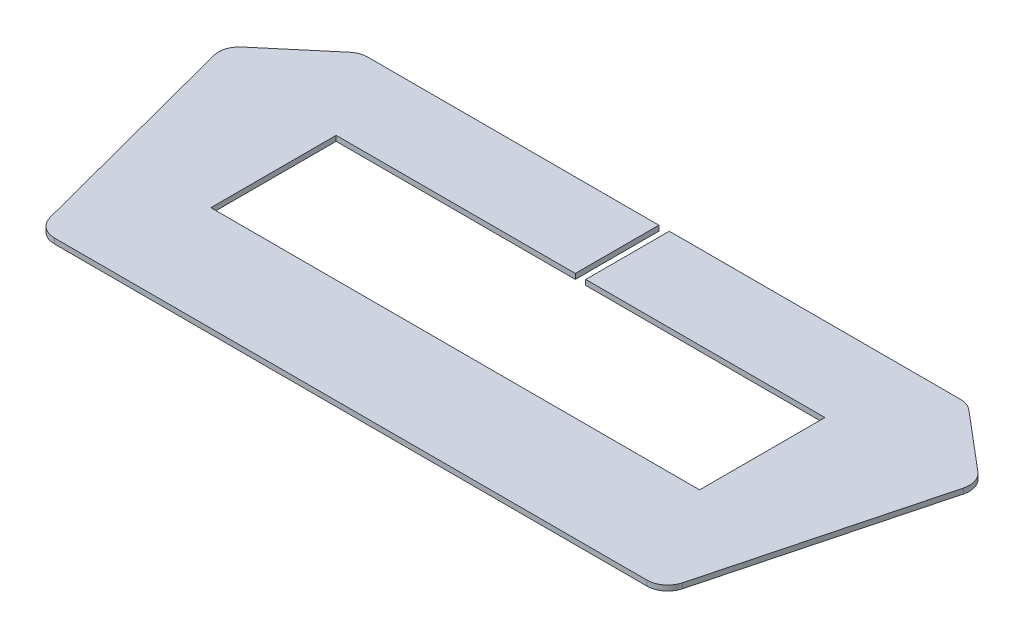
ISO-10303-21;
HEADER;
FILE_DESCRIPTION(('STEP AP214'),'2;1');
FILE_NAME('part.step','',(''),(''),'','','');
FILE_SCHEMA(('AUTOMOTIVE_DESIGN { 1 0 10303 214 1 1 1 1 }'));
ENDSEC;
DATA;
#1=APPLICATION_CONTEXT('core data for automotive mechanical design processes');
#2=APPLICATION_PROTOCOL_DEFINITION('international standard','automotive_design',2000,#1);
#3=PRODUCT_CONTEXT('',#1,'mechanical');
#4=PRODUCT('Part','Part','',(#3));
#5=PRODUCT_RELATED_PRODUCT_CATEGORY('part','',(#4));
#6=PRODUCT_DEFINITION_FORMATION('','',#4);
#7=PRODUCT_DEFINITION_CONTEXT('part definition',#1,'design');
#8=PRODUCT_DEFINITION('design','',#6,#7);
#9=PRODUCT_DEFINITION_SHAPE('','',#8);
#10=(LENGTH_UNIT() NAMED_UNIT(*) SI_UNIT(.MILLI.,.METRE.));
#11=(NAMED_UNIT(*) PLANE_ANGLE_UNIT() SI_UNIT($,.RADIAN.));
#12=(NAMED_UNIT(*) SI_UNIT($,.STERADIAN.) SOLID_ANGLE_UNIT());
#13=UNCERTAINTY_MEASURE_WITH_UNIT(LENGTH_MEASURE(1.E-05),#10,'distance_accuracy_value','');
#14=(GEOMETRIC_REPRESENTATION_CONTEXT(3) GLOBAL_UNCERTAINTY_ASSIGNED_CONTEXT((#13)) GLOBAL_UNIT_ASSIGNED_CONTEXT((#10,
#11,#12)) REPRESENTATION_CONTEXT('',''));
#15=CARTESIAN_POINT('',(0.,0.,0.));
#16=DIRECTION('',(0.,0.,1.));
#17=DIRECTION('',(1.,0.,0.));
#18=AXIS2_PLACEMENT_3D('',#15,#16,#17);
#19=CARTESIAN_POINT('',(-11.7,-0.25,-3.));
#20=DIRECTION('',(1.,0.,0.));
#21=DIRECTION('',(0.,0.,-1.));
#22=AXIS2_PLACEMENT_3D('',#19,#20,#21);
#23=PLANE('',#22);
#24=DIRECTION('',(0.,0.,-1.));
#25=VECTOR('',#24,1.);
#26=CARTESIAN_POINT('',(-11.7,0.,-3.));
#27=LINE('',#26,#25);
#28=CARTESIAN_POINT('',(-11.7,0.,3.));
#29=VERTEX_POINT('',#28);
#30=CARTESIAN_POINT('',(-11.7,0.,-3.));
#31=VERTEX_POINT('',#30);
#32=EDGE_CURVE('E209',#29,#31,#27,.T.);
#33=ORIENTED_EDGE('',*,*,#32,.F.);
#34=DIRECTION('',(0.,1.,0.));
#35=VECTOR('',#34,1.);
#36=CARTESIAN_POINT('',(-11.7,-0.25,3.));
#37=LINE('',#36,#35);
#38=CARTESIAN_POINT('',(-11.7,-0.25,3.));
#39=VERTEX_POINT('',#38);
#40=EDGE_CURVE('E12',#39,#29,#37,.T.);
#41=ORIENTED_EDGE('',*,*,#40,.F.);
#42=DIRECTION('',(0.,0.,-1.));
#43=VECTOR('',#42,1.);
#44=CARTESIAN_POINT('',(-11.7,-0.25,-3.));
#45=LINE('',#44,#43);
#46=CARTESIAN_POINT('',(-11.7,-0.25,-3.));
#47=VERTEX_POINT('',#46);
#48=EDGE_CURVE('E265',#39,#47,#45,.T.);
#49=ORIENTED_EDGE('',*,*,#48,.T.);
#50=DIRECTION('',(0.,1.,0.));
#51=VECTOR('',#50,1.);
#52=CARTESIAN_POINT('',(-11.7,-0.25,-3.));
#53=LINE('',#52,#51);
#54=EDGE_CURVE('E43',#47,#31,#53,.T.);
#55=ORIENTED_EDGE('',*,*,#54,.T.);
#56=EDGE_LOOP('',(#33,#41,#49,#55));
#57=FACE_BOUND('',#56,.T.);
#58=ADVANCED_FACE('F40',(#57),#23,.T.);
#59=CARTESIAN_POINT('',(-11.7,-0.25,3.));
#60=DIRECTION('',(0.,0.,-1.));
#61=DIRECTION('',(-1.,0.,0.));
#62=AXIS2_PLACEMENT_3D('',#59,#60,#61);
#63=PLANE('',#62);
#64=DIRECTION('',(-1.,0.,0.));
#65=VECTOR('',#64,1.);
#66=CARTESIAN_POINT('',(-11.7,0.,3.));
#67=LINE('',#66,#65);
#68=CARTESIAN_POINT('',(11.7,0.,3.));
#69=VERTEX_POINT('',#68);
#70=EDGE_CURVE('E263',#69,#29,#67,.T.);
#71=ORIENTED_EDGE('',*,*,#70,.F.);
#72=DIRECTION('',(0.,1.,0.));
#73=VECTOR('',#72,1.);
#74=CARTESIAN_POINT('',(11.7,-0.25,3.));
#75=LINE('',#74,#73);
#76=CARTESIAN_POINT('',(11.7,-0.25,3.));
#77=VERTEX_POINT('',#76);
#78=EDGE_CURVE('E49',#77,#69,#75,.T.);
#79=ORIENTED_EDGE('',*,*,#78,.F.);
#80=DIRECTION('',(-1.,0.,0.));
#81=VECTOR('',#80,1.);
#82=CARTESIAN_POINT('',(-11.7,-0.25,3.));
#83=LINE('',#82,#81);
#84=EDGE_CURVE('E199',#77,#39,#83,.T.);
#85=ORIENTED_EDGE('',*,*,#84,.T.);
#86=ORIENTED_EDGE('',*,*,#40,.T.);
#87=EDGE_LOOP('',(#71,#79,#85,#86));
#88=FACE_BOUND('',#87,.T.);
#89=ADVANCED_FACE('F301',(#88),#63,.T.);
#90=CARTESIAN_POINT('',(11.7,-0.25,-3.));
#91=DIRECTION('',(-1.,0.,0.));
#92=DIRECTION('',(0.,0.,1.));
#93=AXIS2_PLACEMENT_3D('',#90,#91,#92);
#94=PLANE('',#93);
#95=DIRECTION('',(0.,0.,1.));
#96=VECTOR('',#95,1.);
#97=CARTESIAN_POINT('',(11.7,0.,-3.));
#98=LINE('',#97,#96);
#99=CARTESIAN_POINT('',(11.7,0.,-3.));
#100=VERTEX_POINT('',#99);
#101=EDGE_CURVE('E186',#100,#69,#98,.T.);
#102=ORIENTED_EDGE('',*,*,#101,.F.);
#103=DIRECTION('',(0.,1.,0.));
#104=VECTOR('',#103,1.);
#105=CARTESIAN_POINT('',(11.7,-0.25,-3.));
#106=LINE('',#105,#104);
#107=CARTESIAN_POINT('',(11.7,-0.25,-3.));
#108=VERTEX_POINT('',#107);
#109=EDGE_CURVE('E181',#108,#100,#106,.T.);
#110=ORIENTED_EDGE('',*,*,#109,.F.);
#111=DIRECTION('',(0.,0.,1.));
#112=VECTOR('',#111,1.);
#113=CARTESIAN_POINT('',(11.7,-0.25,-3.));
#114=LINE('',#113,#112);
#115=EDGE_CURVE('E184',#108,#77,#114,.T.);
#116=ORIENTED_EDGE('',*,*,#115,.T.);
#117=ORIENTED_EDGE('',*,*,#78,.T.);
#118=EDGE_LOOP('',(#102,#110,#116,#117));
#119=FACE_BOUND('',#118,.T.);
#120=ADVANCED_FACE('F183',(#119),#94,.T.);
#121=CARTESIAN_POINT('',(0.25,-0.25,-3.));
#122=DIRECTION('',(0.,0.,1.));
#123=DIRECTION('',(1.,0.,0.));
#124=AXIS2_PLACEMENT_3D('',#121,#122,#123);
#125=PLANE('',#124);
#126=DIRECTION('',(1.,0.,0.));
#127=VECTOR('',#126,1.);
#128=CARTESIAN_POINT('',(0.25,0.,-3.));
#129=LINE('',#128,#127);
#130=CARTESIAN_POINT('',(0.25,0.,-3.));
#131=VERTEX_POINT('',#130);
#132=EDGE_CURVE('E260',#131,#100,#129,.T.);
#133=ORIENTED_EDGE('',*,*,#132,.F.);
#134=DIRECTION('',(0.,1.,0.));
#135=VECTOR('',#134,1.);
#136=CARTESIAN_POINT('',(0.25,-0.25,-3.));
#137=LINE('',#136,#135);
#138=CARTESIAN_POINT('',(0.25,-0.25,-3.));
#139=VERTEX_POINT('',#138);
#140=EDGE_CURVE('E191',#139,#131,#137,.T.);
#141=ORIENTED_EDGE('',*,*,#140,.F.);
#142=DIRECTION('',(1.,0.,0.));
#143=VECTOR('',#142,1.);
#144=CARTESIAN_POINT('',(0.25,-0.25,-3.));
#145=LINE('',#144,#143);
#146=EDGE_CURVE('E197',#139,#108,#145,.T.);
#147=ORIENTED_EDGE('',*,*,#146,.T.);
#148=ORIENTED_EDGE('',*,*,#109,.T.);
#149=EDGE_LOOP('',(#133,#141,#147,#148));
#150=FACE_BOUND('',#149,.T.);
#151=ADVANCED_FACE('F201',(#150),#125,.T.);
#152=CARTESIAN_POINT('',(0.249999999999999,-0.25,-7.));
#153=DIRECTION('',(-1.,0.,0.));
#154=DIRECTION('',(0.,0.,1.));
#155=AXIS2_PLACEMENT_3D('',#152,#153,#154);
#156=PLANE('',#155);
#157=DIRECTION('',(0.,0.,1.));
#158=VECTOR('',#157,1.);
#159=CARTESIAN_POINT('',(0.249999999999999,0.,-7.));
#160=LINE('',#159,#158);
#161=CARTESIAN_POINT('',(0.249999999999999,0.,-7.));
#162=VERTEX_POINT('',#161);
#163=EDGE_CURVE('E257',#162,#131,#160,.T.);
#164=ORIENTED_EDGE('',*,*,#163,.F.);
#165=DIRECTION('',(0.,1.,0.));
#166=VECTOR('',#165,1.);
#167=CARTESIAN_POINT('',(0.249999999999999,-0.25,-7.));
#168=LINE('',#167,#166);
#169=CARTESIAN_POINT('',(0.249999999999999,-0.25,-7.));
#170=VERTEX_POINT('',#169);
#171=EDGE_CURVE('E269',#170,#162,#168,.T.);
#172=ORIENTED_EDGE('',*,*,#171,.F.);
#173=DIRECTION('',(0.,0.,1.));
#174=VECTOR('',#173,1.);
#175=CARTESIAN_POINT('',(0.249999999999999,-0.25,-7.));
#176=LINE('',#175,#174);
#177=EDGE_CURVE('E202',#170,#139,#176,.T.);
#178=ORIENTED_EDGE('',*,*,#177,.T.);
#179=ORIENTED_EDGE('',*,*,#140,.T.);
#180=EDGE_LOOP('',(#164,#172,#178,#179));
#181=FACE_BOUND('',#180,.T.);
#182=ADVANCED_FACE('F314',(#181),#156,.T.);
#183=CARTESIAN_POINT('',(0.249999999999999,-0.25,-7.));
#184=DIRECTION('',(0.,0.,-1.));
#185=DIRECTION('',(-1.,0.,0.));
#186=AXIS2_PLACEMENT_3D('',#183,#184,#185);
#187=PLANE('',#186);
#188=DIRECTION('',(-1.,0.,0.));
#189=VECTOR('',#188,1.);
#190=CARTESIAN_POINT('',(0.249999999999999,0.,-7.));
#191=LINE('',#190,#189);
#192=CARTESIAN_POINT('',(14.1840503450521,0.,-7.));
#193=VERTEX_POINT('',#192);
#194=EDGE_CURVE('E254',#193,#162,#191,.T.);
#195=ORIENTED_EDGE('',*,*,#194,.F.);
#196=DIRECTION('',(0.,1.,0.));
#197=VECTOR('',#196,1.);
#198=CARTESIAN_POINT('',(14.1840503450521,-0.25,-7.));
#199=LINE('',#198,#197);
#200=CARTESIAN_POINT('',(14.1840503450521,-0.25,-7.));
#201=VERTEX_POINT('',#200);
#202=EDGE_CURVE('E271',#201,#193,#199,.T.);
#203=ORIENTED_EDGE('',*,*,#202,.F.);
#204=DIRECTION('',(-1.,0.,0.));
#205=VECTOR('',#204,1.);
#206=CARTESIAN_POINT('',(0.249999999999999,-0.25,-7.));
#207=LINE('',#206,#205);
#208=EDGE_CURVE('E204',#201,#170,#207,.T.);
#209=ORIENTED_EDGE('',*,*,#208,.T.);
#210=ORIENTED_EDGE('',*,*,#171,.T.);
#211=EDGE_LOOP('',(#195,#203,#209,#210));
#212=FACE_BOUND('',#211,.T.);
#213=ADVANCED_FACE('F317',(#212),#187,.T.);
#214=CARTESIAN_POINT('',(14.1840503450521,-0.25,-6.));
#215=DIRECTION('',(0.,1.,0.));
#216=DIRECTION('',(0.,0.,1.));
#217=AXIS2_PLACEMENT_3D('',#214,#215,#216);
#218=CYLINDRICAL_SURFACE('',#217,0.999999999999998);
#219=CARTESIAN_POINT('',(14.1840503450521,0.,-6.));
#220=DIRECTION('',(0.,1.,0.));
#221=DIRECTION('',(0.,0.,-1.));
#222=AXIS2_PLACEMENT_3D('',#219,#220,#221);
#223=CIRCLE('',#222,0.999999999999998);
#224=CARTESIAN_POINT('',(14.8295102174988,0.,-6.76379418239535));
#225=VERTEX_POINT('',#224);
#226=EDGE_CURVE('E251',#225,#193,#223,.T.);
#227=ORIENTED_EDGE('',*,*,#226,.F.);
#228=DIRECTION('',(0.,1.,0.));
#229=VECTOR('',#228,1.);
#230=CARTESIAN_POINT('',(14.8295102174988,-0.25,-6.76379418239535));
#231=LINE('',#230,#229);
#232=CARTESIAN_POINT('',(14.8295102174988,-0.25,-6.76379418239535));
#233=VERTEX_POINT('',#232);
#234=EDGE_CURVE('E273',#233,#225,#231,.T.);
#235=ORIENTED_EDGE('',*,*,#234,.F.);
#236=CARTESIAN_POINT('',(14.1840503450521,-0.25,-6.));
#237=DIRECTION('',(0.,1.,0.));
#238=DIRECTION('',(0.,0.,-1.));
#239=AXIS2_PLACEMENT_3D('',#236,#237,#238);
#240=CIRCLE('',#239,0.999999999999998);
#241=EDGE_CURVE('E644',#233,#201,#240,.T.);
#242=ORIENTED_EDGE('',*,*,#241,.T.);
#243=ORIENTED_EDGE('',*,*,#202,.T.);
#244=EDGE_LOOP('',(#227,#235,#242,#243));
#245=FACE_BOUND('',#244,.T.);
#246=ADVANCED_FACE('F321',(#245),#218,.T.);
#247=CARTESIAN_POINT('',(17.6180059015459,-0.25,-4.40731895644008));
#248=DIRECTION('',(0.645459872446779,0.,-0.763794182395355));
#249=DIRECTION('',(-0.763794182395355,0.,-0.645459872446779));
#250=AXIS2_PLACEMENT_3D('',#247,#248,#249);
#251=PLANE('',#250);
#252=DIRECTION('',(-0.763794182395355,0.,-0.645459872446779));
#253=VECTOR('',#252,1.);
#254=CARTESIAN_POINT('',(17.6180059015459,0.,-4.40731895644008));
#255=LINE('',#254,#253);
#256=CARTESIAN_POINT('',(17.6180059015459,0.,-4.40731895644008));
#257=VERTEX_POINT('',#256);
#258=EDGE_CURVE('E248',#257,#225,#255,.T.);
#259=ORIENTED_EDGE('',*,*,#258,.F.);
#260=DIRECTION('',(0.,1.,0.));
#261=VECTOR('',#260,1.);
#262=CARTESIAN_POINT('',(17.6180059015459,-0.25,-4.40731895644008));
#263=LINE('',#262,#261);
#264=CARTESIAN_POINT('',(17.6180059015459,-0.25,-4.40731895644008));
#265=VERTEX_POINT('',#264);
#266=EDGE_CURVE('E275',#265,#257,#263,.T.);
#267=ORIENTED_EDGE('',*,*,#266,.F.);
#268=DIRECTION('',(-0.763794182395355,0.,-0.645459872446779));
#269=VECTOR('',#268,1.);
#270=CARTESIAN_POINT('',(17.6180059015459,-0.25,-4.40731895644008));
#271=LINE('',#270,#269);
#272=EDGE_CURVE('E637',#265,#233,#271,.T.);
#273=ORIENTED_EDGE('',*,*,#272,.T.);
#274=ORIENTED_EDGE('',*,*,#234,.T.);
#275=EDGE_LOOP('',(#259,#267,#273,#274));
#276=FACE_BOUND('',#275,.T.);
#277=ADVANCED_FACE('F325',(#276),#251,.T.);
#278=CARTESIAN_POINT('',(16.9725460290991,-0.25,-3.64352477404472));
#279=DIRECTION('',(0.,1.,0.));
#280=DIRECTION('',(0.,0.,1.));
#281=AXIS2_PLACEMENT_3D('',#278,#279,#280);
#282=CYLINDRICAL_SURFACE('',#281,1.);
#283=CARTESIAN_POINT('',(16.9725460290991,0.,-3.64352477404472));
#284=DIRECTION('',(0.,1.,0.));
#285=DIRECTION('',(0.,0.,-1.));
#286=AXIS2_PLACEMENT_3D('',#283,#284,#285);
#287=CIRCLE('',#286,1.);
#288=CARTESIAN_POINT('',(17.9397769944786,0.,-3.38962664563262));
#289=VERTEX_POINT('',#288);
#290=EDGE_CURVE('E245',#289,#257,#287,.T.);
#291=ORIENTED_EDGE('',*,*,#290,.F.);
#292=DIRECTION('',(0.,1.,0.));
#293=VECTOR('',#292,1.);
#294=CARTESIAN_POINT('',(17.9397769944786,-0.25,-3.38962664563262));
#295=LINE('',#294,#293);
#296=CARTESIAN_POINT('',(17.9397769944786,-0.25,-3.38962664563262));
#297=VERTEX_POINT('',#296);
#298=EDGE_CURVE('E277',#297,#289,#295,.T.);
#299=ORIENTED_EDGE('',*,*,#298,.F.);
#300=CARTESIAN_POINT('',(16.9725460290991,-0.25,-3.64352477404472));
#301=DIRECTION('',(0.,1.,0.));
#302=DIRECTION('',(0.,0.,-1.));
#303=AXIS2_PLACEMENT_3D('',#300,#301,#302);
#304=CIRCLE('',#303,1.);
#305=EDGE_CURVE('E633',#297,#265,#304,.T.);
#306=ORIENTED_EDGE('',*,*,#305,.T.);
#307=ORIENTED_EDGE('',*,*,#266,.T.);
#308=EDGE_LOOP('',(#291,#299,#306,#307));
#309=FACE_BOUND('',#308,.T.);
#310=ADVANCED_FACE('F329',(#309),#282,.T.);
#311=CARTESIAN_POINT('',(15.1458517412918,-0.25,7.2538981284121));
#312=DIRECTION('',(0.967230965379434,0.,0.253898128412102));
#313=DIRECTION('',(0.253898128412102,0.,-0.967230965379434));
#314=AXIS2_PLACEMENT_3D('',#311,#312,#313);
#315=PLANE('',#314);
#316=DIRECTION('',(0.253898128412102,0.,-0.967230965379434));
#317=VECTOR('',#316,1.);
#318=CARTESIAN_POINT('',(15.1458517412918,0.,7.2538981284121));
#319=LINE('',#318,#317);
#320=CARTESIAN_POINT('',(15.1458517412918,0.,7.2538981284121));
#321=VERTEX_POINT('',#320);
#322=EDGE_CURVE('E242',#321,#289,#319,.T.);
#323=ORIENTED_EDGE('',*,*,#322,.F.);
#324=DIRECTION('',(0.,1.,0.));
#325=VECTOR('',#324,1.);
#326=CARTESIAN_POINT('',(15.1458517412918,-0.25,7.2538981284121));
#327=LINE('',#326,#325);
#328=CARTESIAN_POINT('',(15.1458517412918,-0.25,7.2538981284121));
#329=VERTEX_POINT('',#328);
#330=EDGE_CURVE('E279',#329,#321,#327,.T.);
#331=ORIENTED_EDGE('',*,*,#330,.F.);
#332=DIRECTION('',(0.253898128412102,0.,-0.967230965379434));
#333=VECTOR('',#332,1.);
#334=CARTESIAN_POINT('',(15.1458517412918,-0.25,7.2538981284121));
#335=LINE('',#334,#333);
#336=EDGE_CURVE('E649',#329,#297,#335,.T.);
#337=ORIENTED_EDGE('',*,*,#336,.T.);
#338=ORIENTED_EDGE('',*,*,#298,.T.);
#339=EDGE_LOOP('',(#323,#331,#337,#338));
#340=FACE_BOUND('',#339,.T.);
#341=ADVANCED_FACE('F333',(#340),#315,.T.);
#342=CARTESIAN_POINT('',(14.1786207759124,-0.25,7.));
#343=DIRECTION('',(0.,1.,0.));
#344=DIRECTION('',(0.,0.,1.));
#345=AXIS2_PLACEMENT_3D('',#342,#343,#344);
#346=CYLINDRICAL_SURFACE('',#345,1.);
#347=CARTESIAN_POINT('',(14.1786207759124,0.,7.));
#348=DIRECTION('',(0.,1.,0.));
#349=DIRECTION('',(0.,0.,1.));
#350=AXIS2_PLACEMENT_3D('',#347,#348,#349);
#351=CIRCLE('',#350,1.);
#352=CARTESIAN_POINT('',(14.1786207759124,0.,8.));
#353=VERTEX_POINT('',#352);
#354=EDGE_CURVE('E239',#353,#321,#351,.T.);
#355=ORIENTED_EDGE('',*,*,#354,.F.);
#356=DIRECTION('',(0.,1.,0.));
#357=VECTOR('',#356,1.);
#358=CARTESIAN_POINT('',(14.1786207759124,-0.25,8.));
#359=LINE('',#358,#357);
#360=CARTESIAN_POINT('',(14.1786207759124,-0.25,8.));
#361=VERTEX_POINT('',#360);
#362=EDGE_CURVE('E281',#361,#353,#359,.T.);
#363=ORIENTED_EDGE('',*,*,#362,.F.);
#364=CARTESIAN_POINT('',(14.1786207759124,-0.25,7.));
#365=DIRECTION('',(0.,1.,0.));
#366=DIRECTION('',(0.,0.,1.));
#367=AXIS2_PLACEMENT_3D('',#364,#365,#366);
#368=CIRCLE('',#367,1.);
#369=EDGE_CURVE('E626',#361,#329,#368,.T.);
#370=ORIENTED_EDGE('',*,*,#369,.T.);
#371=ORIENTED_EDGE('',*,*,#330,.T.);
#372=EDGE_LOOP('',(#355,#363,#370,#371));
#373=FACE_BOUND('',#372,.T.);
#374=ADVANCED_FACE('F337',(#373),#346,.T.);
#375=CARTESIAN_POINT('',(-14.1786207759124,-0.25,8.));
#376=DIRECTION('',(0.,0.,1.));
#377=DIRECTION('',(1.,0.,0.));
#378=AXIS2_PLACEMENT_3D('',#375,#376,#377);
#379=PLANE('',#378);
#380=DIRECTION('',(1.,0.,0.));
#381=VECTOR('',#380,1.);
#382=CARTESIAN_POINT('',(-14.1786207759124,0.,8.));
#383=LINE('',#382,#381);
#384=CARTESIAN_POINT('',(-14.1786207759124,0.,8.));
#385=VERTEX_POINT('',#384);
#386=EDGE_CURVE('E236',#385,#353,#383,.T.);
#387=ORIENTED_EDGE('',*,*,#386,.F.);
#388=DIRECTION('',(0.,1.,0.));
#389=VECTOR('',#388,1.);
#390=CARTESIAN_POINT('',(-14.1786207759124,-0.25,8.));
#391=LINE('',#390,#389);
#392=CARTESIAN_POINT('',(-14.1786207759124,-0.25,8.));
#393=VERTEX_POINT('',#392);
#394=EDGE_CURVE('E283',#393,#385,#391,.T.);
#395=ORIENTED_EDGE('',*,*,#394,.F.);
#396=DIRECTION('',(1.,0.,0.));
#397=VECTOR('',#396,1.);
#398=CARTESIAN_POINT('',(-14.1786207759124,-0.25,8.));
#399=LINE('',#398,#397);
#400=EDGE_CURVE('E622',#393,#361,#399,.T.);
#401=ORIENTED_EDGE('',*,*,#400,.T.);
#402=ORIENTED_EDGE('',*,*,#362,.T.);
#403=EDGE_LOOP('',(#387,#395,#401,#402));
#404=FACE_BOUND('',#403,.T.);
#405=ADVANCED_FACE('F341',(#404),#379,.T.);
#406=CARTESIAN_POINT('',(-14.1786207759124,-0.25,7.));
#407=DIRECTION('',(0.,1.,0.));
#408=DIRECTION('',(0.,0.,1.));
#409=AXIS2_PLACEMENT_3D('',#406,#407,#408);
#410=CYLINDRICAL_SURFACE('',#409,1.);
#411=CARTESIAN_POINT('',(-14.1786207759124,0.,7.));
#412=DIRECTION('',(0.,1.,0.));
#413=DIRECTION('',(0.,0.,-1.));
#414=AXIS2_PLACEMENT_3D('',#411,#412,#413);
#415=CIRCLE('',#414,1.);
#416=CARTESIAN_POINT('',(-15.1458517412918,0.,7.2538981284121));
#417=VERTEX_POINT('',#416);
#418=EDGE_CURVE('E233',#417,#385,#415,.T.);
#419=ORIENTED_EDGE('',*,*,#418,.F.);
#420=DIRECTION('',(0.,1.,0.));
#421=VECTOR('',#420,1.);
#422=CARTESIAN_POINT('',(-15.1458517412918,-0.25,7.2538981284121));
#423=LINE('',#422,#421);
#424=CARTESIAN_POINT('',(-15.1458517412918,-0.25,7.2538981284121));
#425=VERTEX_POINT('',#424);
#426=EDGE_CURVE('E285',#425,#417,#423,.T.);
#427=ORIENTED_EDGE('',*,*,#426,.F.);
#428=CARTESIAN_POINT('',(-14.1786207759124,-0.25,7.));
#429=DIRECTION('',(0.,1.,0.));
#430=DIRECTION('',(0.,0.,-1.));
#431=AXIS2_PLACEMENT_3D('',#428,#429,#430);
#432=CIRCLE('',#431,1.);
#433=EDGE_CURVE('E653',#425,#393,#432,.T.);
#434=ORIENTED_EDGE('',*,*,#433,.T.);
#435=ORIENTED_EDGE('',*,*,#394,.T.);
#436=EDGE_LOOP('',(#419,#427,#434,#435));
#437=FACE_BOUND('',#436,.T.);
#438=ADVANCED_FACE('F345',(#437),#410,.T.);
#439=CARTESIAN_POINT('',(-15.1458517412918,-0.25,7.2538981284121));
#440=DIRECTION('',(-0.967230965379434,0.,0.253898128412102));
#441=DIRECTION('',(0.253898128412102,0.,0.967230965379434));
#442=AXIS2_PLACEMENT_3D('',#439,#440,#441);
#443=PLANE('',#442);
#444=DIRECTION('',(0.253898128412102,0.,0.967230965379434));
#445=VECTOR('',#444,1.);
#446=CARTESIAN_POINT('',(-15.1458517412918,0.,7.2538981284121));
#447=LINE('',#446,#445);
#448=CARTESIAN_POINT('',(-17.9397769944786,0.,-3.38962664563262));
#449=VERTEX_POINT('',#448);
#450=EDGE_CURVE('E230',#449,#417,#447,.T.);
#451=ORIENTED_EDGE('',*,*,#450,.F.);
#452=DIRECTION('',(0.,1.,0.));
#453=VECTOR('',#452,1.);
#454=CARTESIAN_POINT('',(-17.9397769944786,-0.25,-3.38962664563262));
#455=LINE('',#454,#453);
#456=CARTESIAN_POINT('',(-17.9397769944786,-0.25,-3.38962664563262));
#457=VERTEX_POINT('',#456);
#458=EDGE_CURVE('E287',#457,#449,#455,.T.);
#459=ORIENTED_EDGE('',*,*,#458,.F.);
#460=DIRECTION('',(0.253898128412102,0.,0.967230965379434));
#461=VECTOR('',#460,1.);
#462=CARTESIAN_POINT('',(-15.1458517412918,-0.25,7.2538981284121));
#463=LINE('',#462,#461);
#464=EDGE_CURVE('E615',#457,#425,#463,.T.);
#465=ORIENTED_EDGE('',*,*,#464,.T.);
#466=ORIENTED_EDGE('',*,*,#426,.T.);
#467=EDGE_LOOP('',(#451,#459,#465,#466));
#468=FACE_BOUND('',#467,.T.);
#469=ADVANCED_FACE('F349',(#468),#443,.T.);
#470=CARTESIAN_POINT('',(-16.9725460290991,-0.25,-3.64352477404472));
#471=DIRECTION('',(0.,1.,0.));
#472=DIRECTION('',(0.,0.,1.));
#473=AXIS2_PLACEMENT_3D('',#470,#471,#472);
#474=CYLINDRICAL_SURFACE('',#473,1.);
#475=CARTESIAN_POINT('',(-16.9725460290991,0.,-3.64352477404472));
#476=DIRECTION('',(0.,1.,0.));
#477=DIRECTION('',(0.,0.,-1.));
#478=AXIS2_PLACEMENT_3D('',#475,#476,#477);
#479=CIRCLE('',#478,1.);
#480=CARTESIAN_POINT('',(-17.6180059015459,0.,-4.40731895644007));
#481=VERTEX_POINT('',#480);
#482=EDGE_CURVE('E227',#481,#449,#479,.T.);
#483=ORIENTED_EDGE('',*,*,#482,.F.);
#484=DIRECTION('',(0.,1.,0.));
#485=VECTOR('',#484,1.);
#486=CARTESIAN_POINT('',(-17.6180059015459,-0.25,-4.40731895644007));
#487=LINE('',#486,#485);
#488=CARTESIAN_POINT('',(-17.6180059015459,-0.25,-4.40731895644007));
#489=VERTEX_POINT('',#488);
#490=EDGE_CURVE('E289',#489,#481,#487,.T.);
#491=ORIENTED_EDGE('',*,*,#490,.F.);
#492=CARTESIAN_POINT('',(-16.9725460290991,-0.25,-3.64352477404472));
#493=DIRECTION('',(0.,1.,0.));
#494=DIRECTION('',(0.,0.,-1.));
#495=AXIS2_PLACEMENT_3D('',#492,#493,#494);
#496=CIRCLE('',#495,1.);
#497=EDGE_CURVE('E611',#489,#457,#496,.T.);
#498=ORIENTED_EDGE('',*,*,#497,.T.);
#499=ORIENTED_EDGE('',*,*,#458,.T.);
#500=EDGE_LOOP('',(#483,#491,#498,#499));
#501=FACE_BOUND('',#500,.T.);
#502=ADVANCED_FACE('F353',(#501),#474,.T.);
#503=CARTESIAN_POINT('',(-17.6180059015459,-0.25,-4.40731895644007));
#504=DIRECTION('',(-0.645459872446779,0.,-0.763794182395354));
#505=DIRECTION('',(-0.763794182395354,0.,0.645459872446779));
#506=AXIS2_PLACEMENT_3D('',#503,#504,#505);
#507=PLANE('',#506);
#508=DIRECTION('',(-0.763794182395354,0.,0.64545987244678));
#509=VECTOR('',#508,1.);
#510=CARTESIAN_POINT('',(-17.6180059015459,0.,-4.40731895644007));
#511=LINE('',#510,#509);
#512=CARTESIAN_POINT('',(-14.8295102174988,0.,-6.76379418239535));
#513=VERTEX_POINT('',#512);
#514=EDGE_CURVE('E224',#513,#481,#511,.T.);
#515=ORIENTED_EDGE('',*,*,#514,.F.);
#516=DIRECTION('',(0.,1.,0.));
#517=VECTOR('',#516,1.);
#518=CARTESIAN_POINT('',(-14.8295102174988,-0.25,-6.76379418239535));
#519=LINE('',#518,#517);
#520=CARTESIAN_POINT('',(-14.8295102174988,-0.25,-6.76379418239535));
#521=VERTEX_POINT('',#520);
#522=EDGE_CURVE('E291',#521,#513,#519,.T.);
#523=ORIENTED_EDGE('',*,*,#522,.F.);
#524=DIRECTION('',(-0.763794182395354,0.,0.64545987244678));
#525=VECTOR('',#524,1.);
#526=CARTESIAN_POINT('',(-17.6180059015459,-0.25,-4.40731895644007));
#527=LINE('',#526,#525);
#528=EDGE_CURVE('E657',#521,#489,#527,.T.);
#529=ORIENTED_EDGE('',*,*,#528,.T.);
#530=ORIENTED_EDGE('',*,*,#490,.T.);
#531=EDGE_LOOP('',(#515,#523,#529,#530));
#532=FACE_BOUND('',#531,.T.);
#533=ADVANCED_FACE('F357',(#532),#507,.T.);
#534=CARTESIAN_POINT('',(-14.1840503450521,-0.25,-6.));
#535=DIRECTION('',(0.,1.,0.));
#536=DIRECTION('',(0.,0.,1.));
#537=AXIS2_PLACEMENT_3D('',#534,#535,#536);
#538=CYLINDRICAL_SURFACE('',#537,1.);
#539=CARTESIAN_POINT('',(-14.1840503450521,0.,-6.));
#540=DIRECTION('',(0.,1.,0.));
#541=DIRECTION('',(0.,0.,-1.));
#542=AXIS2_PLACEMENT_3D('',#539,#540,#541);
#543=CIRCLE('',#542,1.);
#544=CARTESIAN_POINT('',(-14.1840503450521,0.,-7.));
#545=VERTEX_POINT('',#544);
#546=EDGE_CURVE('E221',#545,#513,#543,.T.);
#547=ORIENTED_EDGE('',*,*,#546,.F.);
#548=DIRECTION('',(0.,1.,0.));
#549=VECTOR('',#548,1.);
#550=CARTESIAN_POINT('',(-14.1840503450521,-0.25,-7.));
#551=LINE('',#550,#549);
#552=CARTESIAN_POINT('',(-14.1840503450521,-0.25,-7.));
#553=VERTEX_POINT('',#552);
#554=EDGE_CURVE('E293',#553,#545,#551,.T.);
#555=ORIENTED_EDGE('',*,*,#554,.F.);
#556=CARTESIAN_POINT('',(-14.1840503450521,-0.25,-6.));
#557=DIRECTION('',(0.,1.,0.));
#558=DIRECTION('',(0.,0.,-1.));
#559=AXIS2_PLACEMENT_3D('',#556,#557,#558);
#560=CIRCLE('',#559,1.);
#561=EDGE_CURVE('E604',#553,#521,#560,.T.);
#562=ORIENTED_EDGE('',*,*,#561,.T.);
#563=ORIENTED_EDGE('',*,*,#522,.T.);
#564=EDGE_LOOP('',(#547,#555,#562,#563));
#565=FACE_BOUND('',#564,.T.);
#566=ADVANCED_FACE('F361',(#565),#538,.T.);
#567=CARTESIAN_POINT('',(-14.1840503450521,-0.25,-7.));
#568=DIRECTION('',(0.,0.,-1.));
#569=DIRECTION('',(-1.,0.,0.));
#570=AXIS2_PLACEMENT_3D('',#567,#568,#569);
#571=PLANE('',#570);
#572=DIRECTION('',(-1.,0.,0.));
#573=VECTOR('',#572,1.);
#574=CARTESIAN_POINT('',(-14.1840503450521,0.,-7.));
#575=LINE('',#574,#573);
#576=CARTESIAN_POINT('',(-0.250000000000001,0.,-7.));
#577=VERTEX_POINT('',#576);
#578=EDGE_CURVE('E218',#577,#545,#575,.T.);
#579=ORIENTED_EDGE('',*,*,#578,.F.);
#580=DIRECTION('',(0.,1.,0.));
#581=VECTOR('',#580,1.);
#582=CARTESIAN_POINT('',(-0.250000000000001,-0.25,-7.));
#583=LINE('',#582,#581);
#584=CARTESIAN_POINT('',(-0.250000000000001,-0.25,-7.));
#585=VERTEX_POINT('',#584);
#586=EDGE_CURVE('E295',#585,#577,#583,.T.);
#587=ORIENTED_EDGE('',*,*,#586,.F.);
#588=DIRECTION('',(-1.,0.,0.));
#589=VECTOR('',#588,1.);
#590=CARTESIAN_POINT('',(-14.1840503450521,-0.25,-7.));
#591=LINE('',#590,#589);
#592=EDGE_CURVE('E600',#585,#553,#591,.T.);
#593=ORIENTED_EDGE('',*,*,#592,.T.);
#594=ORIENTED_EDGE('',*,*,#554,.T.);
#595=EDGE_LOOP('',(#579,#587,#593,#594));
#596=FACE_BOUND('',#595,.T.);
#597=ADVANCED_FACE('F365',(#596),#571,.T.);
#598=CARTESIAN_POINT('',(-0.250000000000001,-0.25,-7.));
#599=DIRECTION('',(1.,0.,0.));
#600=DIRECTION('',(0.,0.,-1.));
#601=AXIS2_PLACEMENT_3D('',#598,#599,#600);
#602=PLANE('',#601);
#603=DIRECTION('',(0.,0.,-1.));
#604=VECTOR('',#603,1.);
#605=CARTESIAN_POINT('',(-0.250000000000001,0.,-7.));
#606=LINE('',#605,#604);
#607=CARTESIAN_POINT('',(-0.25,0.,-3.));
#608=VERTEX_POINT('',#607);
#609=EDGE_CURVE('E215',#608,#577,#606,.T.);
#610=ORIENTED_EDGE('',*,*,#609,.F.);
#611=DIRECTION('',(0.,1.,0.));
#612=VECTOR('',#611,1.);
#613=CARTESIAN_POINT('',(-0.25,-0.25,-3.));
#614=LINE('',#613,#612);
#615=CARTESIAN_POINT('',(-0.25,-0.25,-3.));
#616=VERTEX_POINT('',#615);
#617=EDGE_CURVE('E296',#616,#608,#614,.T.);
#618=ORIENTED_EDGE('',*,*,#617,.F.);
#619=DIRECTION('',(0.,0.,-1.));
#620=VECTOR('',#619,1.);
#621=CARTESIAN_POINT('',(-0.250000000000001,-0.25,-7.));
#622=LINE('',#621,#620);
#623=EDGE_CURVE('E661',#616,#585,#622,.T.);
#624=ORIENTED_EDGE('',*,*,#623,.T.);
#625=ORIENTED_EDGE('',*,*,#586,.T.);
#626=EDGE_LOOP('',(#610,#618,#624,#625));
#627=FACE_BOUND('',#626,.T.);
#628=ADVANCED_FACE('F369',(#627),#602,.T.);
#629=CARTESIAN_POINT('',(-11.7,-0.25,-3.));
#630=DIRECTION('',(0.,0.,1.));
#631=DIRECTION('',(1.,0.,0.));
#632=AXIS2_PLACEMENT_3D('',#629,#630,#631);
#633=PLANE('',#632);
#634=DIRECTION('',(1.,0.,0.));
#635=VECTOR('',#634,1.);
#636=CARTESIAN_POINT('',(-11.7,0.,-3.));
#637=LINE('',#636,#635);
#638=EDGE_CURVE('E212',#31,#608,#637,.T.);
#639=ORIENTED_EDGE('',*,*,#638,.F.);
#640=ORIENTED_EDGE('',*,*,#54,.F.);
#641=DIRECTION('',(1.,0.,0.));
#642=VECTOR('',#641,1.);
#643=CARTESIAN_POINT('',(-11.7,-0.25,-3.));
#644=LINE('',#643,#642);
#645=EDGE_CURVE('E663',#47,#616,#644,.T.);
#646=ORIENTED_EDGE('',*,*,#645,.T.);
#647=ORIENTED_EDGE('',*,*,#617,.T.);
#648=EDGE_LOOP('',(#639,#640,#646,#647));
#649=FACE_BOUND('',#648,.T.);
#650=ADVANCED_FACE('F298',(#649),#633,.T.);
#651=CARTESIAN_POINT('',(14.1840503450521,-0.25,-6.));
#652=DIRECTION('',(0.,-1.,0.));
#653=DIRECTION('',(0.,0.,-1.));
#654=AXIS2_PLACEMENT_3D('',#651,#652,#653);
#655=PLANE('',#654);
#656=ORIENTED_EDGE('',*,*,#48,.F.);
#657=ORIENTED_EDGE('',*,*,#84,.F.);
#658=ORIENTED_EDGE('',*,*,#115,.F.);
#659=ORIENTED_EDGE('',*,*,#146,.F.);
#660=ORIENTED_EDGE('',*,*,#177,.F.);
#661=ORIENTED_EDGE('',*,*,#208,.F.);
#662=ORIENTED_EDGE('',*,*,#241,.F.);
#663=ORIENTED_EDGE('',*,*,#272,.F.);
#664=ORIENTED_EDGE('',*,*,#305,.F.);
#665=ORIENTED_EDGE('',*,*,#336,.F.);
#666=ORIENTED_EDGE('',*,*,#369,.F.);
#667=ORIENTED_EDGE('',*,*,#400,.F.);
#668=ORIENTED_EDGE('',*,*,#433,.F.);
#669=ORIENTED_EDGE('',*,*,#464,.F.);
#670=ORIENTED_EDGE('',*,*,#497,.F.);
#671=ORIENTED_EDGE('',*,*,#528,.F.);
#672=ORIENTED_EDGE('',*,*,#561,.F.);
#673=ORIENTED_EDGE('',*,*,#592,.F.);
#674=ORIENTED_EDGE('',*,*,#623,.F.);
#675=ORIENTED_EDGE('',*,*,#645,.F.);
#676=EDGE_LOOP('',(#656,#657,#658,#659,#660,#661,#662,#663,#664,#665,#666,#667,#668,#669,#670,
#671,#672,#673,#674,#675));
#677=FACE_BOUND('',#676,.T.);
#678=ADVANCED_FACE('F195',(#677),#655,.T.);
#679=CARTESIAN_POINT('',(14.1840503450521,0.,-6.));
#680=DIRECTION('',(0.,-1.,0.));
#681=DIRECTION('',(0.,0.,-1.));
#682=AXIS2_PLACEMENT_3D('',#679,#680,#681);
#683=PLANE('',#682);
#684=ORIENTED_EDGE('',*,*,#32,.T.);
#685=ORIENTED_EDGE('',*,*,#638,.T.);
#686=ORIENTED_EDGE('',*,*,#609,.T.);
#687=ORIENTED_EDGE('',*,*,#578,.T.);
#688=ORIENTED_EDGE('',*,*,#546,.T.);
#689=ORIENTED_EDGE('',*,*,#514,.T.);
#690=ORIENTED_EDGE('',*,*,#482,.T.);
#691=ORIENTED_EDGE('',*,*,#450,.T.);
#692=ORIENTED_EDGE('',*,*,#418,.T.);
#693=ORIENTED_EDGE('',*,*,#386,.T.);
#694=ORIENTED_EDGE('',*,*,#354,.T.);
#695=ORIENTED_EDGE('',*,*,#322,.T.);
#696=ORIENTED_EDGE('',*,*,#290,.T.);
#697=ORIENTED_EDGE('',*,*,#258,.T.);
#698=ORIENTED_EDGE('',*,*,#226,.T.);
#699=ORIENTED_EDGE('',*,*,#194,.T.);
#700=ORIENTED_EDGE('',*,*,#163,.T.);
#701=ORIENTED_EDGE('',*,*,#132,.T.);
#702=ORIENTED_EDGE('',*,*,#101,.T.);
#703=ORIENTED_EDGE('',*,*,#70,.T.);
#704=EDGE_LOOP('',(#684,#685,#686,#687,#688,#689,#690,#691,#692,#693,#694,#695,#696,#697,#698,
#699,#700,#701,#702,#703));
#705=FACE_BOUND('',#704,.T.);
#706=ADVANCED_FACE('F300',(#705),#683,.F.);
#707=CLOSED_SHELL('',(#58,#89,#120,#151,#182,#213,#246,#277,#310,#341,#374,#405,#438,#469,#502,
#533,#566,#597,#628,#650,#678,#706));
#708=MANIFOLD_SOLID_BREP('B2',#707);
#709=ADVANCED_BREP_SHAPE_REPRESENTATION('',(#18,#708),#14);
#710=SHAPE_DEFINITION_REPRESENTATION(#9,#709);
ENDSEC;
END-ISO-10303-21;
